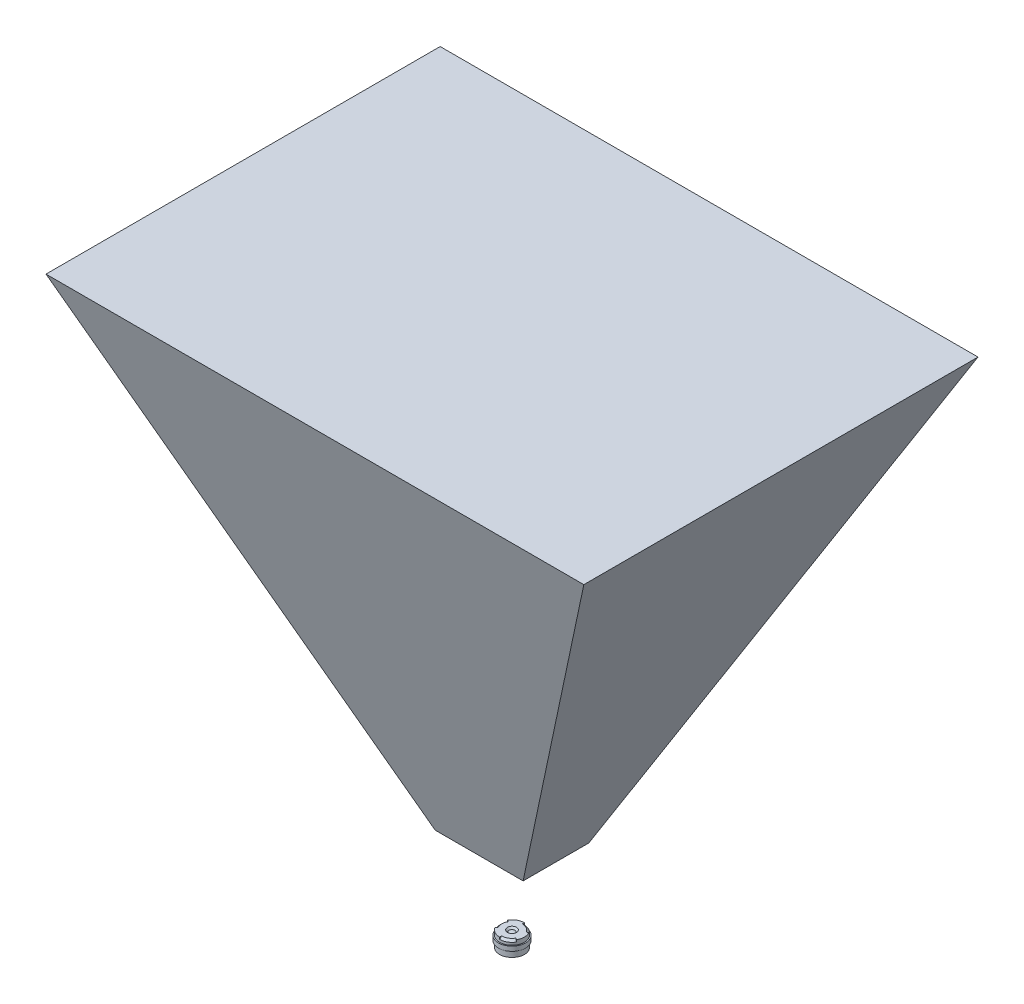
ISO-10303-21;
HEADER;
FILE_DESCRIPTION(('STEP AP214'),'2;1');
FILE_NAME('part.step','',(''),(''),'','','');
FILE_SCHEMA(('AUTOMOTIVE_DESIGN { 1 0 10303 214 1 1 1 1 }'));
ENDSEC;
DATA;
#1=APPLICATION_CONTEXT('core data for automotive mechanical design processes');
#2=APPLICATION_PROTOCOL_DEFINITION('international standard','automotive_design',2000,#1);
#3=PRODUCT_CONTEXT('',#1,'mechanical');
#4=PRODUCT('Part','Part','',(#3));
#5=PRODUCT_RELATED_PRODUCT_CATEGORY('part','',(#4));
#6=PRODUCT_DEFINITION_FORMATION('','',#4);
#7=PRODUCT_DEFINITION_CONTEXT('part definition',#1,'design');
#8=PRODUCT_DEFINITION('design','',#6,#7);
#9=PRODUCT_DEFINITION_SHAPE('','',#8);
#10=(LENGTH_UNIT() NAMED_UNIT(*) SI_UNIT(.MILLI.,.METRE.));
#11=(NAMED_UNIT(*) PLANE_ANGLE_UNIT() SI_UNIT($,.RADIAN.));
#12=(NAMED_UNIT(*) SI_UNIT($,.STERADIAN.) SOLID_ANGLE_UNIT());
#13=UNCERTAINTY_MEASURE_WITH_UNIT(LENGTH_MEASURE(1.E-05),#10,'distance_accuracy_value','');
#14=(GEOMETRIC_REPRESENTATION_CONTEXT(3) GLOBAL_UNCERTAINTY_ASSIGNED_CONTEXT((#13)) GLOBAL_UNIT_ASSIGNED_CONTEXT((#10,
#11,#12)) REPRESENTATION_CONTEXT('',''));
#15=CARTESIAN_POINT('',(0.,0.,0.));
#16=DIRECTION('',(0.,0.,1.));
#17=DIRECTION('',(1.,0.,0.));
#18=AXIS2_PLACEMENT_3D('',#15,#16,#17);
#19=CARTESIAN_POINT('',(100.,118.707826612841,43.6764281119442));
#20=DIRECTION('',(0.,-1.,0.));
#21=DIRECTION('',(0.,0.,-1.));
#22=AXIS2_PLACEMENT_3D('',#19,#20,#21);
#23=PLANE('',#22);
#24=DIRECTION('',(0.,0.,1.));
#25=VECTOR('',#24,1.);
#26=CARTESIAN_POINT('',(-59.5986418977357,118.707826612841,-43.6764281119442));
#27=LINE('',#26,#25);
#28=CARTESIAN_POINT('',(-59.5986418977357,118.707826612841,-43.6764281119442));
#29=VERTEX_POINT('',#28);
#30=CARTESIAN_POINT('',(-59.5986418977357,118.707826612841,43.6764281119442));
#31=VERTEX_POINT('',#30);
#32=EDGE_CURVE('E68',#29,#31,#27,.T.);
#33=ORIENTED_EDGE('',*,*,#32,.T.);
#34=DIRECTION('',(-1.,0.,0.));
#35=VECTOR('',#34,1.);
#36=CARTESIAN_POINT('',(100.,118.707826612841,43.6764281119442));
#37=LINE('',#36,#35);
#38=CARTESIAN_POINT('',(59.5986418977357,118.707826612841,43.6764281119442));
#39=VERTEX_POINT('',#38);
#40=EDGE_CURVE('E98',#39,#31,#37,.T.);
#41=ORIENTED_EDGE('',*,*,#40,.F.);
#42=DIRECTION('',(0.,0.,1.));
#43=VECTOR('',#42,1.);
#44=CARTESIAN_POINT('',(59.5986418977357,118.707826612841,-43.6764281119442));
#45=LINE('',#44,#43);
#46=CARTESIAN_POINT('',(59.5986418977357,118.707826612841,-43.6764281119442));
#47=VERTEX_POINT('',#46);
#48=EDGE_CURVE('E84',#47,#39,#45,.T.);
#49=ORIENTED_EDGE('',*,*,#48,.F.);
#50=DIRECTION('',(-1.,0.,0.));
#51=VECTOR('',#50,1.);
#52=CARTESIAN_POINT('',(100.,118.707826612841,-43.6764281119442));
#53=LINE('',#52,#51);
#54=EDGE_CURVE('E110',#47,#29,#53,.T.);
#55=ORIENTED_EDGE('',*,*,#54,.T.);
#56=EDGE_LOOP('',(#33,#41,#49,#55));
#57=FACE_BOUND('',#56,.T.);
#58=ADVANCED_FACE('F47',(#57),#23,.F.);
#59=CARTESIAN_POINT('',(100.,18.7078266128409,7.27940468532404));
#60=DIRECTION('',(0.,0.342020143325668,-0.939692620785909));
#61=DIRECTION('',(0.,0.939692620785909,0.342020143325668));
#62=AXIS2_PLACEMENT_3D('',#59,#60,#61);
#63=PLANE('',#62);
#64=DIRECTION('',(-0.424258256279285,0.850930418263275,0.309713343679521));
#65=VECTOR('',#64,1.);
#66=CARTESIAN_POINT('',(10.0122642665054,-20.9100514633612,-7.14032367920101));
#67=LINE('',#66,#65);
#68=CARTESIAN_POINT('',(-9.7404810923923,18.7078266128409,7.27940468532404));
#69=VERTEX_POINT('',#68);
#70=EDGE_CURVE('E101',#69,#31,#67,.T.);
#71=ORIENTED_EDGE('',*,*,#70,.F.);
#72=DIRECTION('',(-1.,0.,0.));
#73=VECTOR('',#72,1.);
#74=CARTESIAN_POINT('',(100.,18.7078266128409,7.27940468532404));
#75=LINE('',#74,#73);
#76=CARTESIAN_POINT('',(9.7404810923923,18.7078266128409,7.27940468532404));
#77=VERTEX_POINT('',#76);
#78=EDGE_CURVE('E100',#77,#69,#75,.T.);
#79=ORIENTED_EDGE('',*,*,#78,.F.);
#80=DIRECTION('',(-0.424258256279285,-0.850930418263275,-0.309713343679521));
#81=VECTOR('',#80,1.);
#82=CARTESIAN_POINT('',(25.9867493377224,51.2927996301147,19.139364947979));
#83=LINE('',#82,#81);
#84=EDGE_CURVE('E87',#39,#77,#83,.T.);
#85=ORIENTED_EDGE('',*,*,#84,.F.);
#86=ORIENTED_EDGE('',*,*,#40,.T.);
#87=EDGE_LOOP('',(#71,#79,#85,#86));
#88=FACE_BOUND('',#87,.T.);
#89=ADVANCED_FACE('F97',(#88),#63,.F.);
#90=CARTESIAN_POINT('',(100.,18.7078266128409,7.27940468532404));
#91=DIRECTION('',(0.,1.,0.));
#92=DIRECTION('',(0.,0.,1.));
#93=AXIS2_PLACEMENT_3D('',#90,#91,#92);
#94=PLANE('',#93);
#95=DIRECTION('',(0.,0.,1.));
#96=VECTOR('',#95,1.);
#97=CARTESIAN_POINT('',(-9.7404810923923,18.7078266128409,-43.6764281119442));
#98=LINE('',#97,#96);
#99=CARTESIAN_POINT('',(-9.74048109239232,18.7078266128409,-7.27940468532404));
#100=VERTEX_POINT('',#99);
#101=EDGE_CURVE('E102',#100,#69,#98,.T.);
#102=ORIENTED_EDGE('',*,*,#101,.F.);
#103=DIRECTION('',(-1.,0.,0.));
#104=VECTOR('',#103,1.);
#105=CARTESIAN_POINT('',(100.,18.7078266128409,-7.27940468532404));
#106=LINE('',#105,#104);
#107=CARTESIAN_POINT('',(9.74048109239228,18.7078266128409,-7.27940468532404));
#108=VERTEX_POINT('',#107);
#109=EDGE_CURVE('E105',#108,#100,#106,.T.);
#110=ORIENTED_EDGE('',*,*,#109,.F.);
#111=DIRECTION('',(0.,0.,1.));
#112=VECTOR('',#111,1.);
#113=CARTESIAN_POINT('',(9.7404810923923,18.7078266128409,-43.6764281119442));
#114=LINE('',#113,#112);
#115=EDGE_CURVE('E61',#108,#77,#114,.T.);
#116=ORIENTED_EDGE('',*,*,#115,.T.);
#117=ORIENTED_EDGE('',*,*,#78,.T.);
#118=EDGE_LOOP('',(#102,#110,#116,#117));
#119=FACE_BOUND('',#118,.T.);
#120=ADVANCED_FACE('F119',(#119),#94,.F.);
#121=CARTESIAN_POINT('',(100.,18.7078266128409,-7.27940468532404));
#122=DIRECTION('',(0.,0.342020143325668,0.939692620785909));
#123=DIRECTION('',(0.,-0.939692620785909,0.342020143325668));
#124=AXIS2_PLACEMENT_3D('',#121,#122,#123);
#125=PLANE('',#124);
#126=DIRECTION('',(0.424258256279285,-0.850930418263275,0.309713343679521));
#127=VECTOR('',#126,1.);
#128=CARTESIAN_POINT('',(10.0122642665054,-20.9100514633612,7.14032367920101));
#129=LINE('',#128,#127);
#130=EDGE_CURVE('E13',#29,#100,#129,.T.);
#131=ORIENTED_EDGE('',*,*,#130,.F.);
#132=ORIENTED_EDGE('',*,*,#54,.F.);
#133=DIRECTION('',(0.424258256279285,0.850930418263275,-0.309713343679521));
#134=VECTOR('',#133,1.);
#135=CARTESIAN_POINT('',(25.9867493377224,51.2927996301147,-19.139364947979));
#136=LINE('',#135,#134);
#137=EDGE_CURVE('E54',#108,#47,#136,.T.);
#138=ORIENTED_EDGE('',*,*,#137,.F.);
#139=ORIENTED_EDGE('',*,*,#109,.T.);
#140=EDGE_LOOP('',(#131,#132,#138,#139));
#141=FACE_BOUND('',#140,.T.);
#142=ADVANCED_FACE('F121',(#141),#125,.F.);
#143=CARTESIAN_POINT('',(9.7404810923923,18.7078266128409,-43.6764281119442));
#144=DIRECTION('',(0.894934361602024,-0.44619781310981,0.));
#145=DIRECTION('',(0.44619781310981,0.894934361602024,0.));
#146=AXIS2_PLACEMENT_3D('',#143,#144,#145);
#147=PLANE('',#146);
#148=ORIENTED_EDGE('',*,*,#84,.T.);
#149=ORIENTED_EDGE('',*,*,#115,.F.);
#150=ORIENTED_EDGE('',*,*,#137,.T.);
#151=ORIENTED_EDGE('',*,*,#48,.T.);
#152=EDGE_LOOP('',(#148,#149,#150,#151));
#153=FACE_BOUND('',#152,.T.);
#154=ADVANCED_FACE('F86',(#153),#147,.T.);
#155=CARTESIAN_POINT('',(-9.7404810923923,18.7078266128409,-43.6764281119442));
#156=DIRECTION('',(-0.894934361602024,-0.44619781310981,0.));
#157=DIRECTION('',(0.44619781310981,-0.894934361602024,0.));
#158=AXIS2_PLACEMENT_3D('',#155,#156,#157);
#159=PLANE('',#158);
#160=ORIENTED_EDGE('',*,*,#70,.T.);
#161=ORIENTED_EDGE('',*,*,#32,.F.);
#162=ORIENTED_EDGE('',*,*,#130,.T.);
#163=ORIENTED_EDGE('',*,*,#101,.T.);
#164=EDGE_LOOP('',(#160,#161,#162,#163));
#165=FACE_BOUND('',#164,.T.);
#166=ADVANCED_FACE('F116',(#165),#159,.T.);
#167=CLOSED_SHELL('',(#58,#89,#120,#142,#154,#166));
#168=MANIFOLD_SOLID_BREP('B2',#167);
#169=CARTESIAN_POINT('',(1.,0.8,0.));
#170=DIRECTION('',(0.,-1.,0.));
#171=DIRECTION('',(0.,0.,-1.));
#172=AXIS2_PLACEMENT_3D('',#169,#170,#171);
#173=PLANE('',#172);
#174=CARTESIAN_POINT('',(0.,0.8,0.));
#175=DIRECTION('',(0.,1.,0.));
#176=DIRECTION('',(0.,0.,1.));
#177=AXIS2_PLACEMENT_3D('',#174,#175,#176);
#178=CIRCLE('',#177,1.);
#179=CARTESIAN_POINT('',(0.,0.8,1.));
#180=VERTEX_POINT('',#179);
#181=EDGE_CURVE('E45',#180,#180,#178,.T.);
#182=ORIENTED_EDGE('',*,*,#181,.F.);
#183=EDGE_LOOP('',(#182));
#184=FACE_BOUND('',#183,.T.);
#185=DIRECTION('',(0.,0.,-1.));
#186=VECTOR('',#185,1.);
#187=CARTESIAN_POINT('',(0.,0.8,2.3));
#188=LINE('',#187,#186);
#189=CARTESIAN_POINT('',(0.,0.8,2.75));
#190=VERTEX_POINT('',#189);
#191=CARTESIAN_POINT('',(0.,0.8,2.3));
#192=VERTEX_POINT('',#191);
#193=EDGE_CURVE('E256',#190,#192,#188,.T.);
#194=ORIENTED_EDGE('',*,*,#193,.T.);
#195=CARTESIAN_POINT('',(0.,0.8,0.));
#196=DIRECTION('',(0.,1.,0.));
#197=DIRECTION('',(-0.866025403784443,0.,-0.499999999999992));
#198=AXIS2_PLACEMENT_3D('',#195,#196,#197);
#199=CIRCLE('',#198,2.3);
#200=CARTESIAN_POINT('',(1.99185842870422,0.8,1.14999999999998));
#201=VERTEX_POINT('',#200);
#202=EDGE_CURVE('E241',#192,#201,#199,.T.);
#203=ORIENTED_EDGE('',*,*,#202,.T.);
#204=DIRECTION('',(-0.866025403784443,0.,-0.499999999999992));
#205=VECTOR('',#204,1.);
#206=CARTESIAN_POINT('',(1.99185842870422,0.8,1.14999999999998));
#207=LINE('',#206,#205);
#208=CARTESIAN_POINT('',(2.38156986040722,0.8,1.37499999999998));
#209=VERTEX_POINT('',#208);
#210=EDGE_CURVE('E247',#209,#201,#207,.T.);
#211=ORIENTED_EDGE('',*,*,#210,.F.);
#212=CARTESIAN_POINT('',(0.,0.8,0.));
#213=DIRECTION('',(0.,1.,0.));
#214=DIRECTION('',(0.,0.,1.));
#215=AXIS2_PLACEMENT_3D('',#212,#213,#214);
#216=CIRCLE('',#215,2.75);
#217=CARTESIAN_POINT('',(2.38156986040721,0.8,-1.37499999999999));
#218=VERTEX_POINT('',#217);
#219=EDGE_CURVE('E327',#209,#218,#216,.T.);
#220=ORIENTED_EDGE('',*,*,#219,.T.);
#221=DIRECTION('',(-0.86602540378444,0.,0.499999999999998));
#222=VECTOR('',#221,1.);
#223=CARTESIAN_POINT('',(1.99185842870421,0.8,-1.15));
#224=LINE('',#223,#222);
#225=CARTESIAN_POINT('',(1.99185842870421,0.8,-1.15));
#226=VERTEX_POINT('',#225);
#227=EDGE_CURVE('E290',#218,#226,#224,.T.);
#228=ORIENTED_EDGE('',*,*,#227,.T.);
#229=CARTESIAN_POINT('',(0.,0.8,0.));
#230=DIRECTION('',(0.,1.,0.));
#231=DIRECTION('',(0.,0.,1.));
#232=AXIS2_PLACEMENT_3D('',#229,#230,#231);
#233=CIRCLE('',#232,2.3);
#234=CARTESIAN_POINT('',(0.,0.8,-2.3));
#235=VERTEX_POINT('',#234);
#236=EDGE_CURVE('E298',#226,#235,#233,.T.);
#237=ORIENTED_EDGE('',*,*,#236,.T.);
#238=DIRECTION('',(0.,0.,1.));
#239=VECTOR('',#238,1.);
#240=CARTESIAN_POINT('',(0.,0.8,-2.3));
#241=LINE('',#240,#239);
#242=CARTESIAN_POINT('',(0.,0.8,-2.75));
#243=VERTEX_POINT('',#242);
#244=EDGE_CURVE('E283',#243,#235,#241,.T.);
#245=ORIENTED_EDGE('',*,*,#244,.F.);
#246=CARTESIAN_POINT('',(-2.38156986040721,0.8,-1.37499999999999));
#247=VERTEX_POINT('',#246);
#248=EDGE_CURVE('E178',#243,#247,#216,.T.);
#249=ORIENTED_EDGE('',*,*,#248,.T.);
#250=DIRECTION('',(0.86602540378444,0.,0.499999999999998));
#251=VECTOR('',#250,1.);
#252=CARTESIAN_POINT('',(-1.99185842870421,0.8,-1.15));
#253=LINE('',#252,#251);
#254=CARTESIAN_POINT('',(-1.99185842870421,0.8,-1.15));
#255=VERTEX_POINT('',#254);
#256=EDGE_CURVE('E270',#247,#255,#253,.T.);
#257=ORIENTED_EDGE('',*,*,#256,.T.);
#258=CARTESIAN_POINT('',(0.,0.8,0.));
#259=DIRECTION('',(0.,1.,0.));
#260=DIRECTION('',(0.866025403784436,0.,-0.500000000000004));
#261=AXIS2_PLACEMENT_3D('',#258,#259,#260);
#262=CIRCLE('',#261,2.3);
#263=CARTESIAN_POINT('',(-1.9918584287042,0.8,1.15000000000001));
#264=VERTEX_POINT('',#263);
#265=EDGE_CURVE('E278',#255,#264,#262,.T.);
#266=ORIENTED_EDGE('',*,*,#265,.T.);
#267=DIRECTION('',(0.866025403784436,0.,-0.500000000000004));
#268=VECTOR('',#267,1.);
#269=CARTESIAN_POINT('',(-1.9918584287042,0.8,1.15000000000001));
#270=LINE('',#269,#268);
#271=CARTESIAN_POINT('',(-2.3815698604072,0.8,1.37500000000001));
#272=VERTEX_POINT('',#271);
#273=EDGE_CURVE('E259',#272,#264,#270,.T.);
#274=ORIENTED_EDGE('',*,*,#273,.F.);
#275=EDGE_CURVE('E329',#272,#190,#216,.T.);
#276=ORIENTED_EDGE('',*,*,#275,.T.);
#277=EDGE_LOOP('',(#194,#203,#211,#220,#228,#237,#245,#249,#257,#266,#274,#276));
#278=FACE_BOUND('',#277,.T.);
#279=ADVANCED_FACE('F170',(#184,#278),#173,.F.);
#280=CARTESIAN_POINT('',(0.,0.,0.));
#281=DIRECTION('',(0.,1.,0.));
#282=DIRECTION('',(0.,0.,1.));
#283=AXIS2_PLACEMENT_3D('',#280,#281,#282);
#284=CYLINDRICAL_SURFACE('',#283,2.75);
#285=CARTESIAN_POINT('',(0.,-0.2,0.));
#286=DIRECTION('',(0.,-1.,0.));
#287=DIRECTION('',(0.,0.,-1.));
#288=AXIS2_PLACEMENT_3D('',#285,#286,#287);
#289=CIRCLE('',#288,2.75);
#290=CARTESIAN_POINT('',(0.,-0.2,-2.75));
#291=VERTEX_POINT('',#290);
#292=EDGE_CURVE('E304',#291,#291,#289,.T.);
#293=ORIENTED_EDGE('',*,*,#292,.F.);
#294=EDGE_LOOP('',(#293));
#295=FACE_BOUND('',#294,.T.);
#296=DIRECTION('',(0.,1.,0.));
#297=VECTOR('',#296,1.);
#298=CARTESIAN_POINT('',(0.,0.8,2.75));
#299=LINE('',#298,#297);
#300=CARTESIAN_POINT('',(0.,0.349999999999999,2.75));
#301=VERTEX_POINT('',#300);
#302=EDGE_CURVE('E257',#301,#190,#299,.T.);
#303=ORIENTED_EDGE('',*,*,#302,.T.);
#304=ORIENTED_EDGE('',*,*,#275,.F.);
#305=DIRECTION('',(0.,1.,0.));
#306=VECTOR('',#305,1.);
#307=CARTESIAN_POINT('',(-2.3815698604072,0.8,1.37500000000001));
#308=LINE('',#307,#306);
#309=CARTESIAN_POINT('',(-2.3815698604072,0.349999999999999,1.37500000000001));
#310=VERTEX_POINT('',#309);
#311=EDGE_CURVE('E268',#310,#272,#308,.T.);
#312=ORIENTED_EDGE('',*,*,#311,.F.);
#313=CARTESIAN_POINT('',(0.,0.349999999999999,0.));
#314=DIRECTION('',(0.,1.,0.));
#315=DIRECTION('',(0.866025403784436,0.,-0.500000000000004));
#316=AXIS2_PLACEMENT_3D('',#313,#314,#315);
#317=CIRCLE('',#316,2.75);
#318=CARTESIAN_POINT('',(-2.38156986040721,0.349999999999999,-1.37499999999999));
#319=VERTEX_POINT('',#318);
#320=EDGE_CURVE('E281',#319,#310,#317,.T.);
#321=ORIENTED_EDGE('',*,*,#320,.F.);
#322=DIRECTION('',(0.,1.,0.));
#323=VECTOR('',#322,1.);
#324=CARTESIAN_POINT('',(-2.38156986040721,0.8,-1.37499999999999));
#325=LINE('',#324,#323);
#326=EDGE_CURVE('E275',#319,#247,#325,.T.);
#327=ORIENTED_EDGE('',*,*,#326,.T.);
#328=ORIENTED_EDGE('',*,*,#248,.F.);
#329=DIRECTION('',(0.,1.,0.));
#330=VECTOR('',#329,1.);
#331=CARTESIAN_POINT('',(0.,0.8,-2.75));
#332=LINE('',#331,#330);
#333=CARTESIAN_POINT('',(0.,0.349999999999999,-2.75));
#334=VERTEX_POINT('',#333);
#335=EDGE_CURVE('E288',#334,#243,#332,.T.);
#336=ORIENTED_EDGE('',*,*,#335,.F.);
#337=CARTESIAN_POINT('',(0.,0.349999999999999,0.));
#338=DIRECTION('',(0.,1.,0.));
#339=DIRECTION('',(0.,0.,1.));
#340=AXIS2_PLACEMENT_3D('',#337,#338,#339);
#341=CIRCLE('',#340,2.75);
#342=CARTESIAN_POINT('',(2.38156986040721,0.349999999999999,-1.37499999999999));
#343=VERTEX_POINT('',#342);
#344=EDGE_CURVE('E301',#343,#334,#341,.T.);
#345=ORIENTED_EDGE('',*,*,#344,.F.);
#346=DIRECTION('',(0.,1.,0.));
#347=VECTOR('',#346,1.);
#348=CARTESIAN_POINT('',(2.38156986040721,0.8,-1.37499999999999));
#349=LINE('',#348,#347);
#350=EDGE_CURVE('E295',#343,#218,#349,.T.);
#351=ORIENTED_EDGE('',*,*,#350,.T.);
#352=ORIENTED_EDGE('',*,*,#219,.F.);
#353=DIRECTION('',(0.,1.,0.));
#354=VECTOR('',#353,1.);
#355=CARTESIAN_POINT('',(2.38156986040722,0.8,1.37499999999998));
#356=LINE('',#355,#354);
#357=CARTESIAN_POINT('',(2.38156986040722,0.349999999999999,1.37499999999998));
#358=VERTEX_POINT('',#357);
#359=EDGE_CURVE('E246',#358,#209,#356,.T.);
#360=ORIENTED_EDGE('',*,*,#359,.F.);
#361=CARTESIAN_POINT('',(0.,0.349999999999999,0.));
#362=DIRECTION('',(0.,1.,0.));
#363=DIRECTION('',(-0.866025403784443,0.,-0.499999999999992));
#364=AXIS2_PLACEMENT_3D('',#361,#362,#363);
#365=CIRCLE('',#364,2.75);
#366=EDGE_CURVE('E244',#301,#358,#365,.T.);
#367=ORIENTED_EDGE('',*,*,#366,.F.);
#368=EDGE_LOOP('',(#303,#304,#312,#321,#327,#328,#336,#345,#351,#352,#360,#367));
#369=FACE_BOUND('',#368,.T.);
#370=ADVANCED_FACE('F339',(#295,#369),#284,.T.);
#371=CARTESIAN_POINT('',(0.,-1.2,0.));
#372=DIRECTION('',(0.,-1.,0.));
#373=DIRECTION('',(0.,0.,-1.));
#374=AXIS2_PLACEMENT_3D('',#371,#372,#373);
#375=CIRCLE('',#374,2.75);
#376=CARTESIAN_POINT('',(0.,-1.2,-2.75));
#377=VERTEX_POINT('',#376);
#378=EDGE_CURVE('E313',#377,#377,#375,.T.);
#379=ORIENTED_EDGE('',*,*,#378,.T.);
#380=EDGE_LOOP('',(#379));
#381=FACE_BOUND('',#380,.T.);
#382=CARTESIAN_POINT('',(0.,-2.55,0.));
#383=DIRECTION('',(0.,1.,0.));
#384=DIRECTION('',(0.,0.,1.));
#385=AXIS2_PLACEMENT_3D('',#382,#383,#384);
#386=CIRCLE('',#385,2.75);
#387=CARTESIAN_POINT('',(0.,-2.55,2.75));
#388=VERTEX_POINT('',#387);
#389=EDGE_CURVE('E325',#388,#388,#386,.T.);
#390=ORIENTED_EDGE('',*,*,#389,.T.);
#391=EDGE_LOOP('',(#390));
#392=FACE_BOUND('',#391,.T.);
#393=ADVANCED_FACE('F373',(#381,#392),#284,.T.);
#394=CARTESIAN_POINT('',(2.75,-2.55,0.));
#395=DIRECTION('',(0.,1.,0.));
#396=DIRECTION('',(0.,0.,1.));
#397=AXIS2_PLACEMENT_3D('',#394,#395,#396);
#398=PLANE('',#397);
#399=ORIENTED_EDGE('',*,*,#389,.F.);
#400=EDGE_LOOP('',(#399));
#401=FACE_BOUND('',#400,.T.);
#402=CARTESIAN_POINT('',(0.,-2.55,0.));
#403=DIRECTION('',(0.,1.,0.));
#404=DIRECTION('',(0.,0.,1.));
#405=AXIS2_PLACEMENT_3D('',#402,#403,#404);
#406=CIRCLE('',#405,2.1);
#407=CARTESIAN_POINT('',(0.,-2.55,2.1));
#408=VERTEX_POINT('',#407);
#409=EDGE_CURVE('E322',#408,#408,#406,.T.);
#410=ORIENTED_EDGE('',*,*,#409,.T.);
#411=EDGE_LOOP('',(#410));
#412=FACE_BOUND('',#411,.T.);
#413=ADVANCED_FACE('F378',(#401,#412),#398,.F.);
#414=CARTESIAN_POINT('',(0.,-2.25,0.));
#415=DIRECTION('',(0.,-1.,0.));
#416=DIRECTION('',(0.,0.,-1.));
#417=AXIS2_PLACEMENT_3D('',#414,#415,#416);
#418=CONICAL_SURFACE('',#417,1.8,0.78539816339745);
#419=ORIENTED_EDGE('',*,*,#409,.F.);
#420=EDGE_LOOP('',(#419));
#421=FACE_BOUND('',#420,.T.);
#422=CARTESIAN_POINT('',(0.,-2.25,0.));
#423=DIRECTION('',(0.,1.,0.));
#424=DIRECTION('',(0.,0.,1.));
#425=AXIS2_PLACEMENT_3D('',#422,#423,#424);
#426=CIRCLE('',#425,1.8);
#427=CARTESIAN_POINT('',(0.,-2.25,1.8));
#428=VERTEX_POINT('',#427);
#429=EDGE_CURVE('E319',#428,#428,#426,.T.);
#430=ORIENTED_EDGE('',*,*,#429,.T.);
#431=EDGE_LOOP('',(#430));
#432=FACE_BOUND('',#431,.T.);
#433=ADVANCED_FACE('F381',(#421,#432),#418,.F.);
#434=CARTESIAN_POINT('',(0.,3.,0.));
#435=DIRECTION('',(0.,1.,0.));
#436=DIRECTION('',(1.,0.,0.));
#437=AXIS2_PLACEMENT_3D('',#434,#435,#436);
#438=SPHERICAL_SURFACE('',#437,5.55);
#439=ORIENTED_EDGE('',*,*,#429,.F.);
#440=EDGE_LOOP('',(#439));
#441=FACE_BOUND('',#440,.T.);
#442=ADVANCED_FACE('F385',(#441),#438,.T.);
#443=CARTESIAN_POINT('',(2.75,-1.2,0.));
#444=DIRECTION('',(0.,-1.,0.));
#445=DIRECTION('',(0.,0.,-1.));
#446=AXIS2_PLACEMENT_3D('',#443,#444,#445);
#447=PLANE('',#446);
#448=CARTESIAN_POINT('',(0.,-1.2,0.));
#449=DIRECTION('',(0.,-1.,0.));
#450=DIRECTION('',(0.,0.,-1.));
#451=AXIS2_PLACEMENT_3D('',#448,#449,#450);
#452=CIRCLE('',#451,3.);
#453=CARTESIAN_POINT('',(0.,-1.2,-3.));
#454=VERTEX_POINT('',#453);
#455=EDGE_CURVE('E310',#454,#454,#452,.T.);
#456=ORIENTED_EDGE('',*,*,#455,.T.);
#457=EDGE_LOOP('',(#456));
#458=FACE_BOUND('',#457,.T.);
#459=ORIENTED_EDGE('',*,*,#378,.F.);
#460=EDGE_LOOP('',(#459));
#461=FACE_BOUND('',#460,.T.);
#462=ADVANCED_FACE('F389',(#458,#461),#447,.T.);
#463=CARTESIAN_POINT('',(0.,0.,0.));
#464=DIRECTION('',(0.,-1.,0.));
#465=DIRECTION('',(0.,0.,-1.));
#466=AXIS2_PLACEMENT_3D('',#463,#464,#465);
#467=CYLINDRICAL_SURFACE('',#466,3.);
#468=CARTESIAN_POINT('',(0.,-0.2,0.));
#469=DIRECTION('',(0.,-1.,0.));
#470=DIRECTION('',(0.,0.,-1.));
#471=AXIS2_PLACEMENT_3D('',#468,#469,#470);
#472=CIRCLE('',#471,3.);
#473=CARTESIAN_POINT('',(0.,-0.2,-3.));
#474=VERTEX_POINT('',#473);
#475=EDGE_CURVE('E307',#474,#474,#472,.T.);
#476=ORIENTED_EDGE('',*,*,#475,.T.);
#477=EDGE_LOOP('',(#476));
#478=FACE_BOUND('',#477,.T.);
#479=ORIENTED_EDGE('',*,*,#455,.F.);
#480=EDGE_LOOP('',(#479));
#481=FACE_BOUND('',#480,.T.);
#482=ADVANCED_FACE('F398',(#478,#481),#467,.T.);
#483=CARTESIAN_POINT('',(2.75,-0.2,0.));
#484=DIRECTION('',(0.,1.,0.));
#485=DIRECTION('',(0.,0.,1.));
#486=AXIS2_PLACEMENT_3D('',#483,#484,#485);
#487=PLANE('',#486);
#488=ORIENTED_EDGE('',*,*,#292,.T.);
#489=EDGE_LOOP('',(#488));
#490=FACE_BOUND('',#489,.T.);
#491=ORIENTED_EDGE('',*,*,#475,.F.);
#492=EDGE_LOOP('',(#491));
#493=FACE_BOUND('',#492,.T.);
#494=ADVANCED_FACE('F394',(#490,#493),#487,.T.);
#495=CARTESIAN_POINT('',(0.,-1.478125,0.));
#496=DIRECTION('',(0.,1.,0.));
#497=DIRECTION('',(1.,0.,0.));
#498=AXIS2_PLACEMENT_3D('',#495,#496,#497);
#499=SPHERICAL_SURFACE('',#498,2.003125);
#500=CARTESIAN_POINT('',(0.,0.425,0.));
#501=DIRECTION('',(0.,1.,0.));
#502=DIRECTION('',(0.,0.,1.));
#503=AXIS2_PLACEMENT_3D('',#500,#501,#502);
#504=CIRCLE('',#503,0.625);
#505=CARTESIAN_POINT('',(0.,0.425,0.625));
#506=VERTEX_POINT('',#505);
#507=EDGE_CURVE('E316',#506,#506,#504,.T.);
#508=ORIENTED_EDGE('',*,*,#507,.T.);
#509=EDGE_LOOP('',(#508));
#510=FACE_BOUND('',#509,.T.);
#511=ADVANCED_FACE('F391',(#510),#499,.T.);
#512=CARTESIAN_POINT('',(0.,0.8,0.));
#513=DIRECTION('',(0.,1.,0.));
#514=DIRECTION('',(0.,0.,1.));
#515=AXIS2_PLACEMENT_3D('',#512,#513,#514);
#516=CONICAL_SURFACE('',#515,1.,0.785398163397449);
#517=ORIENTED_EDGE('',*,*,#507,.F.);
#518=EDGE_LOOP('',(#517));
#519=FACE_BOUND('',#518,.T.);
#520=ORIENTED_EDGE('',*,*,#181,.T.);
#521=EDGE_LOOP('',(#520));
#522=FACE_BOUND('',#521,.T.);
#523=ADVANCED_FACE('F172',(#519,#522),#516,.F.);
#524=CARTESIAN_POINT('',(0.,0.8,0.));
#525=DIRECTION('',(0.,-1.,0.));
#526=DIRECTION('',(0.,0.,-1.));
#527=AXIS2_PLACEMENT_3D('',#524,#525,#526);
#528=CONICAL_SURFACE('',#527,2.3,0.785398163397448);
#529=DIRECTION('',(0.612372435695795,-0.707106781186547,-0.353553390593272));
#530=VECTOR('',#529,1.);
#531=CARTESIAN_POINT('',(2.38156986040721,0.349999999999999,-1.37499999999999));
#532=LINE('',#531,#530);
#533=EDGE_CURVE('E293',#226,#343,#532,.T.);
#534=ORIENTED_EDGE('',*,*,#533,.T.);
#535=ORIENTED_EDGE('',*,*,#344,.T.);
#536=DIRECTION('',(0.,-0.707106781186547,-0.707106781186547));
#537=VECTOR('',#536,1.);
#538=CARTESIAN_POINT('',(0.,0.349999999999999,-2.75));
#539=LINE('',#538,#537);
#540=EDGE_CURVE('E286',#235,#334,#539,.T.);
#541=ORIENTED_EDGE('',*,*,#540,.F.);
#542=ORIENTED_EDGE('',*,*,#236,.F.);
#543=EDGE_LOOP('',(#534,#535,#541,#542));
#544=FACE_BOUND('',#543,.T.);
#545=ADVANCED_FACE('F342',(#544),#528,.T.);
#546=CARTESIAN_POINT('',(0.,0.,0.));
#547=DIRECTION('',(-0.499999999999998,0.,-0.86602540378444));
#548=DIRECTION('',(-0.86602540378444,0.,0.499999999999998));
#549=AXIS2_PLACEMENT_3D('',#546,#547,#548);
#550=PLANE('',#549);
#551=ORIENTED_EDGE('',*,*,#227,.F.);
#552=ORIENTED_EDGE('',*,*,#350,.F.);
#553=ORIENTED_EDGE('',*,*,#533,.F.);
#554=EDGE_LOOP('',(#551,#552,#553));
#555=FACE_BOUND('',#554,.T.);
#556=ADVANCED_FACE('F337',(#555),#550,.T.);
#557=CARTESIAN_POINT('',(0.,0.,0.));
#558=DIRECTION('',(-1.,0.,0.));
#559=DIRECTION('',(0.,0.,1.));
#560=AXIS2_PLACEMENT_3D('',#557,#558,#559);
#561=PLANE('',#560);
#562=ORIENTED_EDGE('',*,*,#244,.T.);
#563=ORIENTED_EDGE('',*,*,#540,.T.);
#564=ORIENTED_EDGE('',*,*,#335,.T.);
#565=EDGE_LOOP('',(#562,#563,#564));
#566=FACE_BOUND('',#565,.T.);
#567=ADVANCED_FACE('F410',(#566),#561,.F.);
#568=CARTESIAN_POINT('',(0.,0.8,0.));
#569=DIRECTION('',(0.,-1.,0.));
#570=DIRECTION('',(-0.866025403784436,0.,0.500000000000004));
#571=AXIS2_PLACEMENT_3D('',#568,#569,#570);
#572=CONICAL_SURFACE('',#571,2.3,0.785398163397448);
#573=DIRECTION('',(-0.612372435695795,-0.707106781186547,-0.353553390593272));
#574=VECTOR('',#573,1.);
#575=CARTESIAN_POINT('',(-2.38156986040721,0.349999999999999,-1.37499999999999));
#576=LINE('',#575,#574);
#577=EDGE_CURVE('E273',#255,#319,#576,.T.);
#578=ORIENTED_EDGE('',*,*,#577,.T.);
#579=ORIENTED_EDGE('',*,*,#320,.T.);
#580=DIRECTION('',(-0.612372435695793,-0.707106781186547,0.353553390593277));
#581=VECTOR('',#580,1.);
#582=CARTESIAN_POINT('',(-2.3815698604072,0.349999999999999,1.37500000000001));
#583=LINE('',#582,#581);
#584=EDGE_CURVE('E193',#264,#310,#583,.T.);
#585=ORIENTED_EDGE('',*,*,#584,.F.);
#586=ORIENTED_EDGE('',*,*,#265,.F.);
#587=EDGE_LOOP('',(#578,#579,#585,#586));
#588=FACE_BOUND('',#587,.T.);
#589=ADVANCED_FACE('F353',(#588),#572,.T.);
#590=CARTESIAN_POINT('',(0.,0.,0.));
#591=DIRECTION('',(-0.499999999999998,0.,0.86602540378444));
#592=DIRECTION('',(0.86602540378444,0.,0.499999999999998));
#593=AXIS2_PLACEMENT_3D('',#590,#591,#592);
#594=PLANE('',#593);
#595=ORIENTED_EDGE('',*,*,#256,.F.);
#596=ORIENTED_EDGE('',*,*,#326,.F.);
#597=ORIENTED_EDGE('',*,*,#577,.F.);
#598=EDGE_LOOP('',(#595,#596,#597));
#599=FACE_BOUND('',#598,.T.);
#600=ADVANCED_FACE('F349',(#599),#594,.T.);
#601=CARTESIAN_POINT('',(0.,0.,0.));
#602=DIRECTION('',(0.500000000000004,0.,0.866025403784436));
#603=DIRECTION('',(0.866025403784436,0.,-0.500000000000004));
#604=AXIS2_PLACEMENT_3D('',#601,#602,#603);
#605=PLANE('',#604);
#606=ORIENTED_EDGE('',*,*,#273,.T.);
#607=ORIENTED_EDGE('',*,*,#584,.T.);
#608=ORIENTED_EDGE('',*,*,#311,.T.);
#609=EDGE_LOOP('',(#606,#607,#608));
#610=FACE_BOUND('',#609,.T.);
#611=ADVANCED_FACE('F354',(#610),#605,.F.);
#612=CARTESIAN_POINT('',(0.,0.8,0.));
#613=DIRECTION('',(0.,-1.,0.));
#614=DIRECTION('',(0.866025403784443,0.,0.499999999999992));
#615=AXIS2_PLACEMENT_3D('',#612,#613,#614);
#616=CONICAL_SURFACE('',#615,2.3,0.785398163397448);
#617=DIRECTION('',(0.,-0.707106781186547,0.707106781186547));
#618=VECTOR('',#617,1.);
#619=CARTESIAN_POINT('',(0.,0.349999999999999,2.75));
#620=LINE('',#619,#618);
#621=EDGE_CURVE('E262',#192,#301,#620,.T.);
#622=ORIENTED_EDGE('',*,*,#621,.T.);
#623=ORIENTED_EDGE('',*,*,#366,.T.);
#624=DIRECTION('',(0.612372435695798,-0.707106781186547,0.353553390593268));
#625=VECTOR('',#624,1.);
#626=CARTESIAN_POINT('',(2.38156986040722,0.349999999999999,1.37499999999998));
#627=LINE('',#626,#625);
#628=EDGE_CURVE('E185',#201,#358,#627,.T.);
#629=ORIENTED_EDGE('',*,*,#628,.F.);
#630=ORIENTED_EDGE('',*,*,#202,.F.);
#631=EDGE_LOOP('',(#622,#623,#629,#630));
#632=FACE_BOUND('',#631,.T.);
#633=ADVANCED_FACE('F239',(#632),#616,.T.);
#634=CARTESIAN_POINT('',(0.,0.,0.));
#635=DIRECTION('',(1.,0.,0.));
#636=DIRECTION('',(0.,0.,-1.));
#637=AXIS2_PLACEMENT_3D('',#634,#635,#636);
#638=PLANE('',#637);
#639=ORIENTED_EDGE('',*,*,#193,.F.);
#640=ORIENTED_EDGE('',*,*,#302,.F.);
#641=ORIENTED_EDGE('',*,*,#621,.F.);
#642=EDGE_LOOP('',(#639,#640,#641));
#643=FACE_BOUND('',#642,.T.);
#644=ADVANCED_FACE('F357',(#643),#638,.T.);
#645=CARTESIAN_POINT('',(0.,0.,0.));
#646=DIRECTION('',(0.499999999999992,0.,-0.866025403784443));
#647=DIRECTION('',(-0.866025403784443,0.,-0.499999999999992));
#648=AXIS2_PLACEMENT_3D('',#645,#646,#647);
#649=PLANE('',#648);
#650=ORIENTED_EDGE('',*,*,#210,.T.);
#651=ORIENTED_EDGE('',*,*,#628,.T.);
#652=ORIENTED_EDGE('',*,*,#359,.T.);
#653=EDGE_LOOP('',(#650,#651,#652));
#654=FACE_BOUND('',#653,.T.);
#655=ADVANCED_FACE('F250',(#654),#649,.F.);
#656=CLOSED_SHELL('',(#279,#370,#393,#413,#433,#442,#462,#482,#494,#511,#523,#545,#556,#567,
#589,#600,#611,#633,#644,#655));
#657=MANIFOLD_SOLID_BREP('B7',#656);
#658=ADVANCED_BREP_SHAPE_REPRESENTATION('',(#18,#168,#657),#14);
#659=SHAPE_DEFINITION_REPRESENTATION(#9,#658);
ENDSEC;
END-ISO-10303-21;
